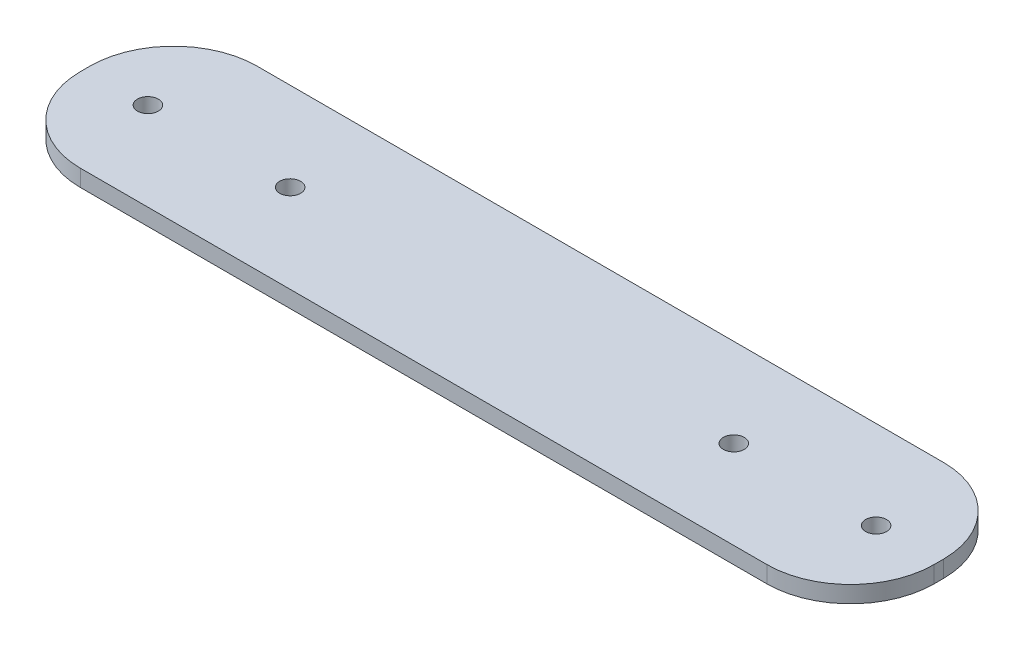
ISO-10303-21;
HEADER;
FILE_DESCRIPTION(('STEP AP214'),'2;1');
FILE_NAME('part.step','',(''),(''),'','','');
FILE_SCHEMA(('AUTOMOTIVE_DESIGN { 1 0 10303 214 1 1 1 1 }'));
ENDSEC;
DATA;
#1=APPLICATION_CONTEXT('core data for automotive mechanical design processes');
#2=APPLICATION_PROTOCOL_DEFINITION('international standard','automotive_design',2000,#1);
#3=PRODUCT_CONTEXT('',#1,'mechanical');
#4=PRODUCT('Part','Part','',(#3));
#5=PRODUCT_RELATED_PRODUCT_CATEGORY('part','',(#4));
#6=PRODUCT_DEFINITION_FORMATION('','',#4);
#7=PRODUCT_DEFINITION_CONTEXT('part definition',#1,'design');
#8=PRODUCT_DEFINITION('design','',#6,#7);
#9=PRODUCT_DEFINITION_SHAPE('','',#8);
#10=(LENGTH_UNIT() NAMED_UNIT(*) SI_UNIT(.MILLI.,.METRE.));
#11=(NAMED_UNIT(*) PLANE_ANGLE_UNIT() SI_UNIT($,.RADIAN.));
#12=(NAMED_UNIT(*) SI_UNIT($,.STERADIAN.) SOLID_ANGLE_UNIT());
#13=UNCERTAINTY_MEASURE_WITH_UNIT(LENGTH_MEASURE(1.E-05),#10,'distance_accuracy_value','');
#14=(GEOMETRIC_REPRESENTATION_CONTEXT(3) GLOBAL_UNCERTAINTY_ASSIGNED_CONTEXT((#13)) GLOBAL_UNIT_ASSIGNED_CONTEXT((#10,
#11,#12)) REPRESENTATION_CONTEXT('',''));
#15=CARTESIAN_POINT('',(0.,0.,0.));
#16=DIRECTION('',(0.,0.,1.));
#17=DIRECTION('',(1.,0.,0.));
#18=AXIS2_PLACEMENT_3D('',#15,#16,#17);
#19=CARTESIAN_POINT('',(0.,2.,0.));
#20=DIRECTION('',(0.,1.,0.));
#21=DIRECTION('',(0.,0.,-1.));
#22=AXIS2_PLACEMENT_3D('',#19,#20,#21);
#23=PLANE('',#22);
#24=CARTESIAN_POINT('',(-26.5000000000001,2.,0.));
#25=DIRECTION('',(0.,-1.,0.));
#26=DIRECTION('',(0.,0.,-1.));
#27=AXIS2_PLACEMENT_3D('',#24,#25,#26);
#28=CIRCLE('',#27,1.25);
#29=CARTESIAN_POINT('',(-26.5000000000001,2.,-1.24999999999993));
#30=VERTEX_POINT('',#29);
#31=EDGE_CURVE('E243',#30,#30,#28,.T.);
#32=ORIENTED_EDGE('',*,*,#31,.T.);
#33=EDGE_LOOP('',(#32));
#34=FACE_BOUND('',#33,.T.);
#35=CARTESIAN_POINT('',(43.5,2.,0.));
#36=DIRECTION('',(0.,-1.,0.));
#37=DIRECTION('',(0.,0.,-1.));
#38=AXIS2_PLACEMENT_3D('',#35,#36,#37);
#39=CIRCLE('',#38,1.24999999999999);
#40=CARTESIAN_POINT('',(43.5,2.,-1.24999999999989));
#41=VERTEX_POINT('',#40);
#42=EDGE_CURVE('E178',#41,#41,#39,.T.);
#43=ORIENTED_EDGE('',*,*,#42,.T.);
#44=EDGE_LOOP('',(#43));
#45=FACE_BOUND('',#44,.T.);
#46=DIRECTION('',(0.,0.,1.));
#47=VECTOR('',#46,1.);
#48=CARTESIAN_POINT('',(51.,2.,10.5583756345178));
#49=LINE('',#48,#47);
#50=CARTESIAN_POINT('',(51.,2.,-0.558375634517773));
#51=VERTEX_POINT('',#50);
#52=CARTESIAN_POINT('',(51.,2.,0.558375634517773));
#53=VERTEX_POINT('',#52);
#54=EDGE_CURVE('E170',#51,#53,#49,.T.);
#55=ORIENTED_EDGE('',*,*,#54,.F.);
#56=CARTESIAN_POINT('',(41.,2.,-0.558375634517773));
#57=DIRECTION('',(0.,-1.,0.));
#58=DIRECTION('',(0.,0.,-1.));
#59=AXIS2_PLACEMENT_3D('',#56,#57,#58);
#60=CIRCLE('',#59,10.);
#61=CARTESIAN_POINT('',(41.,2.,-10.5583756345178));
#62=VERTEX_POINT('',#61);
#63=EDGE_CURVE('E152',#62,#51,#60,.T.);
#64=ORIENTED_EDGE('',*,*,#63,.F.);
#65=DIRECTION('',(1.,0.,0.));
#66=VECTOR('',#65,1.);
#67=CARTESIAN_POINT('',(-51.,2.,-10.5583756345178));
#68=LINE('',#67,#66);
#69=CARTESIAN_POINT('',(-41.,2.,-10.5583756345178));
#70=VERTEX_POINT('',#69);
#71=EDGE_CURVE('E131',#70,#62,#68,.T.);
#72=ORIENTED_EDGE('',*,*,#71,.F.);
#73=CARTESIAN_POINT('',(-41.,2.,-0.558375634517773));
#74=DIRECTION('',(0.,-1.,0.));
#75=DIRECTION('',(0.,0.,-1.));
#76=AXIS2_PLACEMENT_3D('',#73,#74,#75);
#77=CIRCLE('',#76,10.);
#78=CARTESIAN_POINT('',(-51.,2.,-0.558375634517773));
#79=VERTEX_POINT('',#78);
#80=EDGE_CURVE('E147',#79,#70,#77,.T.);
#81=ORIENTED_EDGE('',*,*,#80,.F.);
#82=DIRECTION('',(0.,0.,-1.));
#83=VECTOR('',#82,1.);
#84=CARTESIAN_POINT('',(-51.,2.,10.5583756345178));
#85=LINE('',#84,#83);
#86=CARTESIAN_POINT('',(-51.,2.,0.558375634517773));
#87=VERTEX_POINT('',#86);
#88=EDGE_CURVE('E128',#87,#79,#85,.T.);
#89=ORIENTED_EDGE('',*,*,#88,.F.);
#90=CARTESIAN_POINT('',(-41.,2.,0.558375634517773));
#91=DIRECTION('',(0.,-1.,0.));
#92=DIRECTION('',(0.,0.,-1.));
#93=AXIS2_PLACEMENT_3D('',#90,#91,#92);
#94=CIRCLE('',#93,10.);
#95=CARTESIAN_POINT('',(-41.,2.,10.5583756345178));
#96=VERTEX_POINT('',#95);
#97=EDGE_CURVE('E149',#96,#87,#94,.T.);
#98=ORIENTED_EDGE('',*,*,#97,.F.);
#99=DIRECTION('',(-1.,0.,0.));
#100=VECTOR('',#99,1.);
#101=CARTESIAN_POINT('',(-51.,2.,10.5583756345178));
#102=LINE('',#101,#100);
#103=CARTESIAN_POINT('',(41.,2.,10.5583756345178));
#104=VERTEX_POINT('',#103);
#105=EDGE_CURVE('E137',#104,#96,#102,.T.);
#106=ORIENTED_EDGE('',*,*,#105,.F.);
#107=CARTESIAN_POINT('',(41.,2.,0.558375634517773));
#108=DIRECTION('',(0.,-1.,0.));
#109=DIRECTION('',(0.,0.,-1.));
#110=AXIS2_PLACEMENT_3D('',#107,#108,#109);
#111=CIRCLE('',#110,10.);
#112=EDGE_CURVE('E106',#53,#104,#111,.T.);
#113=ORIENTED_EDGE('',*,*,#112,.F.);
#114=EDGE_LOOP('',(#55,#64,#72,#81,#89,#98,#106,#113));
#115=FACE_BOUND('',#114,.T.);
#116=CARTESIAN_POINT('',(26.5,2.,0.));
#117=DIRECTION('',(0.,-1.,0.));
#118=DIRECTION('',(0.,0.,-1.));
#119=AXIS2_PLACEMENT_3D('',#116,#117,#118);
#120=CIRCLE('',#119,1.24999999999999);
#121=CARTESIAN_POINT('',(26.5,2.,-1.2499999999999));
#122=VERTEX_POINT('',#121);
#123=EDGE_CURVE('E238',#122,#122,#120,.T.);
#124=ORIENTED_EDGE('',*,*,#123,.T.);
#125=EDGE_LOOP('',(#124));
#126=FACE_BOUND('',#125,.T.);
#127=CARTESIAN_POINT('',(-43.5000000000001,2.,0.));
#128=DIRECTION('',(0.,-1.,0.));
#129=DIRECTION('',(0.,0.,-1.));
#130=AXIS2_PLACEMENT_3D('',#127,#128,#129);
#131=CIRCLE('',#130,1.25);
#132=CARTESIAN_POINT('',(-43.5000000000001,2.,-1.24999999999993));
#133=VERTEX_POINT('',#132);
#134=EDGE_CURVE('E262',#133,#133,#131,.T.);
#135=ORIENTED_EDGE('',*,*,#134,.T.);
#136=EDGE_LOOP('',(#135));
#137=FACE_BOUND('',#136,.T.);
#138=ADVANCED_FACE('F35',(#34,#45,#115,#126,#137),#23,.T.);
#139=CARTESIAN_POINT('',(0.,0.,0.));
#140=DIRECTION('',(0.,1.,0.));
#141=DIRECTION('',(0.,0.,-1.));
#142=AXIS2_PLACEMENT_3D('',#139,#140,#141);
#143=PLANE('',#142);
#144=DIRECTION('',(-1.,0.,0.));
#145=VECTOR('',#144,1.);
#146=CARTESIAN_POINT('',(-51.,0.,10.5583756345178));
#147=LINE('',#146,#145);
#148=CARTESIAN_POINT('',(41.,0.,10.5583756345178));
#149=VERTEX_POINT('',#148);
#150=CARTESIAN_POINT('',(-41.,0.,10.5583756345178));
#151=VERTEX_POINT('',#150);
#152=EDGE_CURVE('E119',#149,#151,#147,.T.);
#153=ORIENTED_EDGE('',*,*,#152,.T.);
#154=CARTESIAN_POINT('',(-41.,0.,0.558375634517773));
#155=DIRECTION('',(0.,-1.,0.));
#156=DIRECTION('',(0.,0.,-1.));
#157=AXIS2_PLACEMENT_3D('',#154,#155,#156);
#158=CIRCLE('',#157,10.);
#159=CARTESIAN_POINT('',(-51.,0.,0.558375634517773));
#160=VERTEX_POINT('',#159);
#161=EDGE_CURVE('E141',#160,#151,#158,.F.);
#162=ORIENTED_EDGE('',*,*,#161,.F.);
#163=DIRECTION('',(0.,0.,-1.));
#164=VECTOR('',#163,1.);
#165=CARTESIAN_POINT('',(-51.,0.,10.5583756345178));
#166=LINE('',#165,#164);
#167=CARTESIAN_POINT('',(-51.,0.,-0.558375634517773));
#168=VERTEX_POINT('',#167);
#169=EDGE_CURVE('E177',#160,#168,#166,.T.);
#170=ORIENTED_EDGE('',*,*,#169,.T.);
#171=CARTESIAN_POINT('',(-41.,0.,-0.558375634517773));
#172=DIRECTION('',(0.,-1.,0.));
#173=DIRECTION('',(0.,0.,-1.));
#174=AXIS2_PLACEMENT_3D('',#171,#172,#173);
#175=CIRCLE('',#174,10.);
#176=CARTESIAN_POINT('',(-41.,0.,-10.5583756345178));
#177=VERTEX_POINT('',#176);
#178=EDGE_CURVE('E111',#177,#168,#175,.F.);
#179=ORIENTED_EDGE('',*,*,#178,.F.);
#180=DIRECTION('',(1.,0.,0.));
#181=VECTOR('',#180,1.);
#182=CARTESIAN_POINT('',(-51.,0.,-10.5583756345178));
#183=LINE('',#182,#181);
#184=CARTESIAN_POINT('',(41.,0.,-10.5583756345178));
#185=VERTEX_POINT('',#184);
#186=EDGE_CURVE('E133',#177,#185,#183,.T.);
#187=ORIENTED_EDGE('',*,*,#186,.T.);
#188=CARTESIAN_POINT('',(41.,0.,-0.558375634517773));
#189=DIRECTION('',(0.,-1.,0.));
#190=DIRECTION('',(0.,0.,-1.));
#191=AXIS2_PLACEMENT_3D('',#188,#189,#190);
#192=CIRCLE('',#191,10.);
#193=CARTESIAN_POINT('',(51.,0.,-0.558375634517773));
#194=VERTEX_POINT('',#193);
#195=EDGE_CURVE('E124',#194,#185,#192,.F.);
#196=ORIENTED_EDGE('',*,*,#195,.F.);
#197=DIRECTION('',(0.,0.,1.));
#198=VECTOR('',#197,1.);
#199=CARTESIAN_POINT('',(51.,0.,10.5583756345178));
#200=LINE('',#199,#198);
#201=CARTESIAN_POINT('',(51.,0.,0.558375634517773));
#202=VERTEX_POINT('',#201);
#203=EDGE_CURVE('E122',#194,#202,#200,.T.);
#204=ORIENTED_EDGE('',*,*,#203,.T.);
#205=CARTESIAN_POINT('',(41.,0.,0.558375634517773));
#206=DIRECTION('',(0.,-1.,0.));
#207=DIRECTION('',(0.,0.,-1.));
#208=AXIS2_PLACEMENT_3D('',#205,#206,#207);
#209=CIRCLE('',#208,10.);
#210=EDGE_CURVE('E103',#149,#202,#209,.F.);
#211=ORIENTED_EDGE('',*,*,#210,.F.);
#212=EDGE_LOOP('',(#153,#162,#170,#179,#187,#196,#204,#211));
#213=FACE_BOUND('',#212,.T.);
#214=CARTESIAN_POINT('',(43.5,0.,0.));
#215=DIRECTION('',(0.,-1.,0.));
#216=DIRECTION('',(0.,0.,-1.));
#217=AXIS2_PLACEMENT_3D('',#214,#215,#216);
#218=CIRCLE('',#217,1.24999999999999);
#219=CARTESIAN_POINT('',(43.5,0.,-1.24999999999989));
#220=VERTEX_POINT('',#219);
#221=EDGE_CURVE('E245',#220,#220,#218,.T.);
#222=ORIENTED_EDGE('',*,*,#221,.F.);
#223=EDGE_LOOP('',(#222));
#224=FACE_BOUND('',#223,.T.);
#225=CARTESIAN_POINT('',(26.5,0.,0.));
#226=DIRECTION('',(0.,-1.,0.));
#227=DIRECTION('',(0.,0.,-1.));
#228=AXIS2_PLACEMENT_3D('',#225,#226,#227);
#229=CIRCLE('',#228,1.24999999999999);
#230=CARTESIAN_POINT('',(26.5,0.,-1.2499999999999));
#231=VERTEX_POINT('',#230);
#232=EDGE_CURVE('E241',#231,#231,#229,.T.);
#233=ORIENTED_EDGE('',*,*,#232,.F.);
#234=EDGE_LOOP('',(#233));
#235=FACE_BOUND('',#234,.T.);
#236=CARTESIAN_POINT('',(-26.5000000000001,0.,0.));
#237=DIRECTION('',(0.,-1.,0.));
#238=DIRECTION('',(0.,0.,-1.));
#239=AXIS2_PLACEMENT_3D('',#236,#237,#238);
#240=CIRCLE('',#239,1.25);
#241=CARTESIAN_POINT('',(-26.5000000000001,0.,-1.24999999999993));
#242=VERTEX_POINT('',#241);
#243=EDGE_CURVE('E247',#242,#242,#240,.T.);
#244=ORIENTED_EDGE('',*,*,#243,.F.);
#245=EDGE_LOOP('',(#244));
#246=FACE_BOUND('',#245,.T.);
#247=CARTESIAN_POINT('',(-43.5000000000001,0.,0.));
#248=DIRECTION('',(0.,-1.,0.));
#249=DIRECTION('',(0.,0.,-1.));
#250=AXIS2_PLACEMENT_3D('',#247,#248,#249);
#251=CIRCLE('',#250,1.25);
#252=CARTESIAN_POINT('',(-43.5000000000001,0.,-1.24999999999993));
#253=VERTEX_POINT('',#252);
#254=EDGE_CURVE('E261',#253,#253,#251,.T.);
#255=ORIENTED_EDGE('',*,*,#254,.F.);
#256=EDGE_LOOP('',(#255));
#257=FACE_BOUND('',#256,.T.);
#258=ADVANCED_FACE('F116',(#213,#224,#235,#246,#257),#143,.F.);
#259=CARTESIAN_POINT('',(-51.,2.,10.5583756345178));
#260=DIRECTION('',(1.,0.,0.));
#261=DIRECTION('',(0.,0.,1.));
#262=AXIS2_PLACEMENT_3D('',#259,#260,#261);
#263=PLANE('',#262);
#264=ORIENTED_EDGE('',*,*,#88,.T.);
#265=DIRECTION('',(0.,-1.,0.));
#266=VECTOR('',#265,1.);
#267=CARTESIAN_POINT('',(-51.,2.,-0.558375634517773));
#268=LINE('',#267,#266);
#269=EDGE_CURVE('E43',#168,#79,#268,.F.);
#270=ORIENTED_EDGE('',*,*,#269,.F.);
#271=ORIENTED_EDGE('',*,*,#169,.F.);
#272=DIRECTION('',(0.,-1.,0.));
#273=VECTOR('',#272,1.);
#274=CARTESIAN_POINT('',(-51.,2.,0.558375634517773));
#275=LINE('',#274,#273);
#276=EDGE_CURVE('E11',#87,#160,#275,.T.);
#277=ORIENTED_EDGE('',*,*,#276,.F.);
#278=EDGE_LOOP('',(#264,#270,#271,#277));
#279=FACE_BOUND('',#278,.T.);
#280=ADVANCED_FACE('F164',(#279),#263,.F.);
#281=CARTESIAN_POINT('',(-51.,2.,-10.5583756345178));
#282=DIRECTION('',(0.,0.,1.));
#283=DIRECTION('',(-1.,0.,0.));
#284=AXIS2_PLACEMENT_3D('',#281,#282,#283);
#285=PLANE('',#284);
#286=ORIENTED_EDGE('',*,*,#186,.F.);
#287=DIRECTION('',(0.,-1.,0.));
#288=VECTOR('',#287,1.);
#289=CARTESIAN_POINT('',(-41.,2.,-10.5583756345178));
#290=LINE('',#289,#288);
#291=EDGE_CURVE('E57',#70,#177,#290,.T.);
#292=ORIENTED_EDGE('',*,*,#291,.F.);
#293=ORIENTED_EDGE('',*,*,#71,.T.);
#294=DIRECTION('',(0.,-1.,0.));
#295=VECTOR('',#294,1.);
#296=CARTESIAN_POINT('',(41.,2.,-10.5583756345178));
#297=LINE('',#296,#295);
#298=EDGE_CURVE('E50',#185,#62,#297,.F.);
#299=ORIENTED_EDGE('',*,*,#298,.F.);
#300=EDGE_LOOP('',(#286,#292,#293,#299));
#301=FACE_BOUND('',#300,.T.);
#302=ADVANCED_FACE('F180',(#301),#285,.F.);
#303=CARTESIAN_POINT('',(51.,2.,10.5583756345178));
#304=DIRECTION('',(-1.,0.,0.));
#305=DIRECTION('',(0.,0.,-1.));
#306=AXIS2_PLACEMENT_3D('',#303,#304,#305);
#307=PLANE('',#306);
#308=ORIENTED_EDGE('',*,*,#203,.F.);
#309=DIRECTION('',(0.,-1.,0.));
#310=VECTOR('',#309,1.);
#311=CARTESIAN_POINT('',(51.,2.,-0.558375634517773));
#312=LINE('',#311,#310);
#313=EDGE_CURVE('E123',#51,#194,#312,.T.);
#314=ORIENTED_EDGE('',*,*,#313,.F.);
#315=ORIENTED_EDGE('',*,*,#54,.T.);
#316=DIRECTION('',(0.,-1.,0.));
#317=VECTOR('',#316,1.);
#318=CARTESIAN_POINT('',(51.,2.,0.558375634517773));
#319=LINE('',#318,#317);
#320=EDGE_CURVE('E145',#202,#53,#319,.F.);
#321=ORIENTED_EDGE('',*,*,#320,.F.);
#322=EDGE_LOOP('',(#308,#314,#315,#321));
#323=FACE_BOUND('',#322,.T.);
#324=ADVANCED_FACE('F183',(#323),#307,.F.);
#325=CARTESIAN_POINT('',(-51.,2.,10.5583756345178));
#326=DIRECTION('',(0.,0.,-1.));
#327=DIRECTION('',(1.,0.,0.));
#328=AXIS2_PLACEMENT_3D('',#325,#326,#327);
#329=PLANE('',#328);
#330=ORIENTED_EDGE('',*,*,#105,.T.);
#331=DIRECTION('',(0.,-1.,0.));
#332=VECTOR('',#331,1.);
#333=CARTESIAN_POINT('',(-41.,2.,10.5583756345178));
#334=LINE('',#333,#332);
#335=EDGE_CURVE('E112',#151,#96,#334,.F.);
#336=ORIENTED_EDGE('',*,*,#335,.F.);
#337=ORIENTED_EDGE('',*,*,#152,.F.);
#338=DIRECTION('',(0.,-1.,0.));
#339=VECTOR('',#338,1.);
#340=CARTESIAN_POINT('',(41.,2.,10.5583756345178));
#341=LINE('',#340,#339);
#342=EDGE_CURVE('E100',#104,#149,#341,.T.);
#343=ORIENTED_EDGE('',*,*,#342,.F.);
#344=EDGE_LOOP('',(#330,#336,#337,#343));
#345=FACE_BOUND('',#344,.T.);
#346=ADVANCED_FACE('F126',(#345),#329,.F.);
#347=CARTESIAN_POINT('',(43.5,2.,0.));
#348=DIRECTION('',(0.,-1.,0.));
#349=DIRECTION('',(0.,0.,1.));
#350=AXIS2_PLACEMENT_3D('',#347,#348,#349);
#351=CYLINDRICAL_SURFACE('',#350,1.24999999999999);
#352=ORIENTED_EDGE('',*,*,#42,.F.);
#353=EDGE_LOOP('',(#352));
#354=FACE_BOUND('',#353,.T.);
#355=ORIENTED_EDGE('',*,*,#221,.T.);
#356=EDGE_LOOP('',(#355));
#357=FACE_BOUND('',#356,.T.);
#358=ADVANCED_FACE('F202',(#354,#357),#351,.F.);
#359=CARTESIAN_POINT('',(26.5,2.,0.));
#360=DIRECTION('',(0.,-1.,0.));
#361=DIRECTION('',(0.,0.,1.));
#362=AXIS2_PLACEMENT_3D('',#359,#360,#361);
#363=CYLINDRICAL_SURFACE('',#362,1.24999999999999);
#364=ORIENTED_EDGE('',*,*,#123,.F.);
#365=EDGE_LOOP('',(#364));
#366=FACE_BOUND('',#365,.T.);
#367=ORIENTED_EDGE('',*,*,#232,.T.);
#368=EDGE_LOOP('',(#367));
#369=FACE_BOUND('',#368,.T.);
#370=ADVANCED_FACE('F224',(#366,#369),#363,.F.);
#371=CARTESIAN_POINT('',(-26.5000000000001,2.,0.));
#372=DIRECTION('',(0.,-1.,0.));
#373=DIRECTION('',(0.,0.,1.));
#374=AXIS2_PLACEMENT_3D('',#371,#372,#373);
#375=CYLINDRICAL_SURFACE('',#374,1.25);
#376=ORIENTED_EDGE('',*,*,#31,.F.);
#377=EDGE_LOOP('',(#376));
#378=FACE_BOUND('',#377,.T.);
#379=ORIENTED_EDGE('',*,*,#243,.T.);
#380=EDGE_LOOP('',(#379));
#381=FACE_BOUND('',#380,.T.);
#382=ADVANCED_FACE('F218',(#378,#381),#375,.F.);
#383=CARTESIAN_POINT('',(-43.5000000000001,2.,0.));
#384=DIRECTION('',(0.,-1.,0.));
#385=DIRECTION('',(0.,0.,1.));
#386=AXIS2_PLACEMENT_3D('',#383,#384,#385);
#387=CYLINDRICAL_SURFACE('',#386,1.25);
#388=ORIENTED_EDGE('',*,*,#134,.F.);
#389=EDGE_LOOP('',(#388));
#390=FACE_BOUND('',#389,.T.);
#391=ORIENTED_EDGE('',*,*,#254,.T.);
#392=EDGE_LOOP('',(#391));
#393=FACE_BOUND('',#392,.T.);
#394=ADVANCED_FACE('F214',(#390,#393),#387,.F.);
#395=CARTESIAN_POINT('',(41.,2.,0.558375634517773));
#396=DIRECTION('',(0.,-1.,0.));
#397=DIRECTION('',(0.,0.,1.));
#398=AXIS2_PLACEMENT_3D('',#395,#396,#397);
#399=CYLINDRICAL_SURFACE('',#398,10.);
#400=ORIENTED_EDGE('',*,*,#112,.T.);
#401=ORIENTED_EDGE('',*,*,#342,.T.);
#402=ORIENTED_EDGE('',*,*,#210,.T.);
#403=ORIENTED_EDGE('',*,*,#320,.T.);
#404=EDGE_LOOP('',(#400,#401,#402,#403));
#405=FACE_BOUND('',#404,.T.);
#406=ADVANCED_FACE('F102',(#405),#399,.T.);
#407=CARTESIAN_POINT('',(41.,2.,-0.558375634517773));
#408=DIRECTION('',(0.,-1.,0.));
#409=DIRECTION('',(0.,0.,1.));
#410=AXIS2_PLACEMENT_3D('',#407,#408,#409);
#411=CYLINDRICAL_SURFACE('',#410,10.);
#412=ORIENTED_EDGE('',*,*,#63,.T.);
#413=ORIENTED_EDGE('',*,*,#313,.T.);
#414=ORIENTED_EDGE('',*,*,#195,.T.);
#415=ORIENTED_EDGE('',*,*,#298,.T.);
#416=EDGE_LOOP('',(#412,#413,#414,#415));
#417=FACE_BOUND('',#416,.T.);
#418=ADVANCED_FACE('F181',(#417),#411,.T.);
#419=CARTESIAN_POINT('',(-41.,2.,0.558375634517773));
#420=DIRECTION('',(0.,-1.,0.));
#421=DIRECTION('',(0.,0.,1.));
#422=AXIS2_PLACEMENT_3D('',#419,#420,#421);
#423=CYLINDRICAL_SURFACE('',#422,10.);
#424=ORIENTED_EDGE('',*,*,#97,.T.);
#425=ORIENTED_EDGE('',*,*,#276,.T.);
#426=ORIENTED_EDGE('',*,*,#161,.T.);
#427=ORIENTED_EDGE('',*,*,#335,.T.);
#428=EDGE_LOOP('',(#424,#425,#426,#427));
#429=FACE_BOUND('',#428,.T.);
#430=ADVANCED_FACE('F185',(#429),#423,.T.);
#431=CARTESIAN_POINT('',(-41.,2.,-0.558375634517773));
#432=DIRECTION('',(0.,-1.,0.));
#433=DIRECTION('',(0.,0.,1.));
#434=AXIS2_PLACEMENT_3D('',#431,#432,#433);
#435=CYLINDRICAL_SURFACE('',#434,10.);
#436=ORIENTED_EDGE('',*,*,#80,.T.);
#437=ORIENTED_EDGE('',*,*,#291,.T.);
#438=ORIENTED_EDGE('',*,*,#178,.T.);
#439=ORIENTED_EDGE('',*,*,#269,.T.);
#440=EDGE_LOOP('',(#436,#437,#438,#439));
#441=FACE_BOUND('',#440,.T.);
#442=ADVANCED_FACE('F37',(#441),#435,.T.);
#443=CLOSED_SHELL('',(#138,#258,#280,#302,#324,#346,#358,#370,#382,#394,#406,#418,#430,#442));
#444=MANIFOLD_SOLID_BREP('B2',#443);
#445=ADVANCED_BREP_SHAPE_REPRESENTATION('',(#18,#444),#14);
#446=SHAPE_DEFINITION_REPRESENTATION(#9,#445);
ENDSEC;
END-ISO-10303-21;
